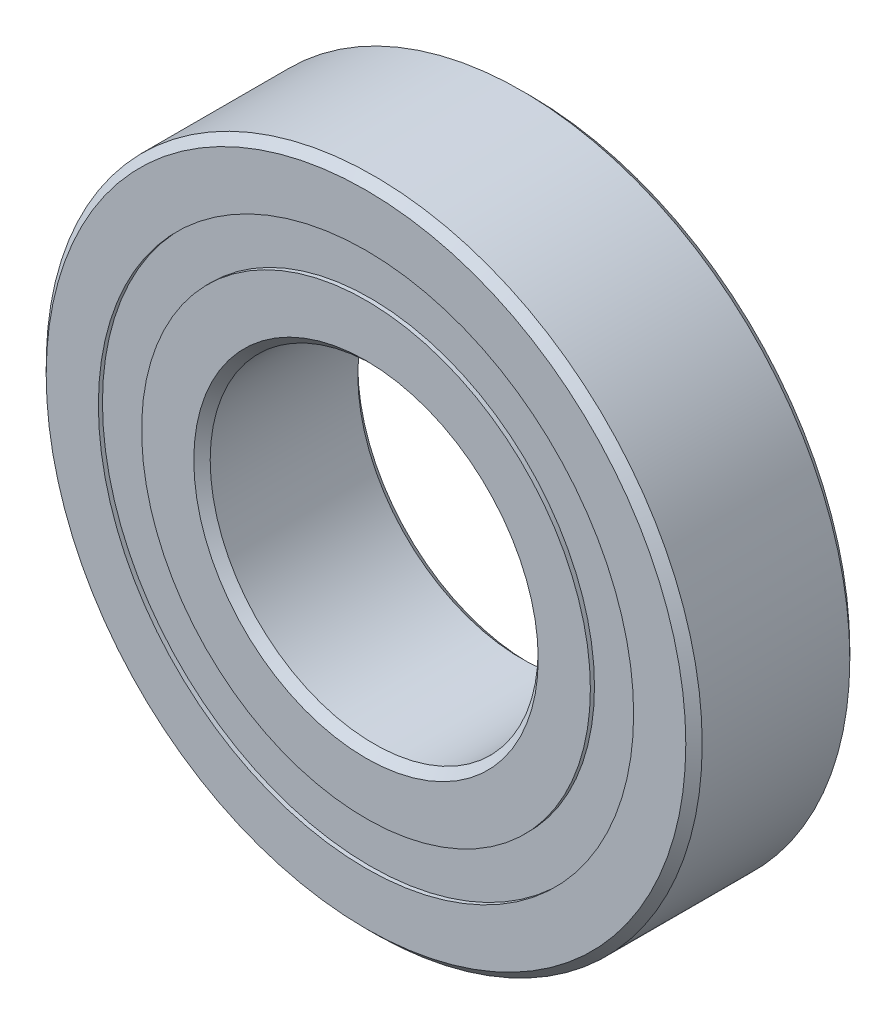
ISO-10303-21;
HEADER;
FILE_DESCRIPTION(('STEP AP214'),'2;1');
FILE_NAME('part.step','',(''),(''),'','','');
FILE_SCHEMA(('AUTOMOTIVE_DESIGN { 1 0 10303 214 1 1 1 1 }'));
ENDSEC;
DATA;
#1=APPLICATION_CONTEXT('core data for automotive mechanical design processes');
#2=APPLICATION_PROTOCOL_DEFINITION('international standard','automotive_design',2000,#1);
#3=PRODUCT_CONTEXT('',#1,'mechanical');
#4=PRODUCT('Part','Part','',(#3));
#5=PRODUCT_RELATED_PRODUCT_CATEGORY('part','',(#4));
#6=PRODUCT_DEFINITION_FORMATION('','',#4);
#7=PRODUCT_DEFINITION_CONTEXT('part definition',#1,'design');
#8=PRODUCT_DEFINITION('design','',#6,#7);
#9=PRODUCT_DEFINITION_SHAPE('','',#8);
#10=(LENGTH_UNIT() NAMED_UNIT(*) SI_UNIT(.MILLI.,.METRE.));
#11=(NAMED_UNIT(*) PLANE_ANGLE_UNIT() SI_UNIT($,.RADIAN.));
#12=(NAMED_UNIT(*) SI_UNIT($,.STERADIAN.) SOLID_ANGLE_UNIT());
#13=UNCERTAINTY_MEASURE_WITH_UNIT(LENGTH_MEASURE(1.E-05),#10,'distance_accuracy_value','');
#14=(GEOMETRIC_REPRESENTATION_CONTEXT(3) GLOBAL_UNCERTAINTY_ASSIGNED_CONTEXT((#13)) GLOBAL_UNIT_ASSIGNED_CONTEXT((#10,
#11,#12)) REPRESENTATION_CONTEXT('',''));
#15=CARTESIAN_POINT('',(0.,0.,0.));
#16=DIRECTION('',(0.,0.,1.));
#17=DIRECTION('',(1.,0.,0.));
#18=AXIS2_PLACEMENT_3D('',#15,#16,#17);
#19=CARTESIAN_POINT('',(0.,20.7247252747253,-6.0325));
#20=DIRECTION('',(0.,0.,1.));
#21=DIRECTION('',(1.,0.,0.));
#22=AXIS2_PLACEMENT_3D('',#19,#20,#21);
#23=PLANE('',#22);
#24=CARTESIAN_POINT('',(0.,0.,-6.0325));
#25=DIRECTION('',(0.,0.,1.));
#26=DIRECTION('',(1.,0.,0.));
#27=AXIS2_PLACEMENT_3D('',#24,#25,#26);
#28=CIRCLE('',#27,20.7247252747253);
#29=CARTESIAN_POINT('',(20.7247252747253,0.,-6.0325));
#30=VERTEX_POINT('',#29);
#31=EDGE_CURVE('E61',#30,#30,#28,.T.);
#32=ORIENTED_EDGE('',*,*,#31,.F.);
#33=EDGE_LOOP('',(#32));
#34=FACE_BOUND('',#33,.T.);
#35=CARTESIAN_POINT('',(0.,0.,-6.0325));
#36=DIRECTION('',(0.,0.,1.));
#37=DIRECTION('',(1.,0.,0.));
#38=AXIS2_PLACEMENT_3D('',#35,#36,#37);
#39=CIRCLE('',#38,17.3752747252747);
#40=CARTESIAN_POINT('',(17.3752747252747,0.,-6.0325));
#41=VERTEX_POINT('',#40);
#42=EDGE_CURVE('E11',#41,#41,#39,.T.);
#43=ORIENTED_EDGE('',*,*,#42,.T.);
#44=EDGE_LOOP('',(#43));
#45=FACE_BOUND('',#44,.T.);
#46=ADVANCED_FACE('F47',(#34,#45),#23,.F.);
#47=CARTESIAN_POINT('',(0.,0.,6.35));
#48=DIRECTION('',(0.,0.,1.));
#49=DIRECTION('',(1.,0.,0.));
#50=AXIS2_PLACEMENT_3D('',#47,#48,#49);
#51=CYLINDRICAL_SURFACE('',#50,17.3752747252747);
#52=ORIENTED_EDGE('',*,*,#42,.F.);
#53=EDGE_LOOP('',(#52));
#54=FACE_BOUND('',#53,.T.);
#55=CARTESIAN_POINT('',(0.,0.,-3.28171342706955));
#56=DIRECTION('',(0.,0.,1.));
#57=DIRECTION('',(1.,0.,0.));
#58=AXIS2_PLACEMENT_3D('',#55,#56,#57);
#59=CIRCLE('',#58,17.3752747252747);
#60=CARTESIAN_POINT('',(17.3752747252747,0.,-3.28171342706955));
#61=VERTEX_POINT('',#60);
#62=EDGE_CURVE('E53',#61,#61,#59,.T.);
#63=ORIENTED_EDGE('',*,*,#62,.T.);
#64=EDGE_LOOP('',(#63));
#65=FACE_BOUND('',#64,.T.);
#66=ADVANCED_FACE('F70',(#54,#65),#51,.F.);
#67=CARTESIAN_POINT('',(0.,20.7247252747253,-3.28171342706955));
#68=DIRECTION('',(0.,0.,-1.));
#69=DIRECTION('',(-1.,0.,0.));
#70=AXIS2_PLACEMENT_3D('',#67,#68,#69);
#71=PLANE('',#70);
#72=ORIENTED_EDGE('',*,*,#62,.F.);
#73=EDGE_LOOP('',(#72));
#74=FACE_BOUND('',#73,.T.);
#75=CARTESIAN_POINT('',(0.,0.,-3.28171342706955));
#76=DIRECTION('',(0.,0.,1.));
#77=DIRECTION('',(1.,0.,0.));
#78=AXIS2_PLACEMENT_3D('',#75,#76,#77);
#79=CIRCLE('',#78,20.7247252747253);
#80=CARTESIAN_POINT('',(20.7247252747253,0.,-3.28171342706955));
#81=VERTEX_POINT('',#80);
#82=EDGE_CURVE('E57',#81,#81,#79,.T.);
#83=ORIENTED_EDGE('',*,*,#82,.T.);
#84=EDGE_LOOP('',(#83));
#85=FACE_BOUND('',#84,.T.);
#86=ADVANCED_FACE('F74',(#74,#85),#71,.F.);
#87=CARTESIAN_POINT('',(0.,0.,6.35));
#88=DIRECTION('',(0.,0.,1.));
#89=DIRECTION('',(1.,0.,0.));
#90=AXIS2_PLACEMENT_3D('',#87,#88,#89);
#91=CYLINDRICAL_SURFACE('',#90,20.7247252747253);
#92=ORIENTED_EDGE('',*,*,#82,.F.);
#93=EDGE_LOOP('',(#92));
#94=FACE_BOUND('',#93,.T.);
#95=ORIENTED_EDGE('',*,*,#31,.T.);
#96=EDGE_LOOP('',(#95));
#97=FACE_BOUND('',#96,.T.);
#98=ADVANCED_FACE('F67',(#94,#97),#91,.T.);
#99=CLOSED_SHELL('',(#46,#66,#86,#98));
#100=MANIFOLD_SOLID_BREP('B2',#99);
#101=CARTESIAN_POINT('',(0.,20.7247252747253,6.0325));
#102=DIRECTION('',(0.,0.,-1.));
#103=DIRECTION('',(-1.,0.,0.));
#104=AXIS2_PLACEMENT_3D('',#101,#102,#103);
#105=PLANE('',#104);
#106=CARTESIAN_POINT('',(0.,0.,6.0325));
#107=DIRECTION('',(0.,0.,1.));
#108=DIRECTION('',(1.,0.,0.));
#109=AXIS2_PLACEMENT_3D('',#106,#107,#108);
#110=CIRCLE('',#109,17.3752747252747);
#111=CARTESIAN_POINT('',(17.3752747252747,0.,6.0325));
#112=VERTEX_POINT('',#111);
#113=EDGE_CURVE('E46',#112,#112,#110,.T.);
#114=ORIENTED_EDGE('',*,*,#113,.F.);
#115=EDGE_LOOP('',(#114));
#116=FACE_BOUND('',#115,.T.);
#117=CARTESIAN_POINT('',(0.,0.,6.0325));
#118=DIRECTION('',(0.,0.,1.));
#119=DIRECTION('',(1.,0.,0.));
#120=AXIS2_PLACEMENT_3D('',#117,#118,#119);
#121=CIRCLE('',#120,20.7247252747253);
#122=CARTESIAN_POINT('',(20.7247252747253,0.,6.0325));
#123=VERTEX_POINT('',#122);
#124=EDGE_CURVE('E129',#123,#123,#121,.T.);
#125=ORIENTED_EDGE('',*,*,#124,.T.);
#126=EDGE_LOOP('',(#125));
#127=FACE_BOUND('',#126,.T.);
#128=ADVANCED_FACE('F115',(#116,#127),#105,.F.);
#129=CARTESIAN_POINT('',(0.,0.,6.35));
#130=DIRECTION('',(0.,0.,1.));
#131=DIRECTION('',(1.,0.,0.));
#132=AXIS2_PLACEMENT_3D('',#129,#130,#131);
#133=CYLINDRICAL_SURFACE('',#132,17.3752747252747);
#134=CARTESIAN_POINT('',(0.,0.,3.28171342706955));
#135=DIRECTION('',(0.,0.,1.));
#136=DIRECTION('',(1.,0.,0.));
#137=AXIS2_PLACEMENT_3D('',#134,#135,#136);
#138=CIRCLE('',#137,17.3752747252747);
#139=CARTESIAN_POINT('',(17.3752747252747,0.,3.28171342706955));
#140=VERTEX_POINT('',#139);
#141=EDGE_CURVE('E121',#140,#140,#138,.T.);
#142=ORIENTED_EDGE('',*,*,#141,.F.);
#143=EDGE_LOOP('',(#142));
#144=FACE_BOUND('',#143,.T.);
#145=ORIENTED_EDGE('',*,*,#113,.T.);
#146=EDGE_LOOP('',(#145));
#147=FACE_BOUND('',#146,.T.);
#148=ADVANCED_FACE('F144',(#144,#147),#133,.F.);
#149=CARTESIAN_POINT('',(0.,20.7247252747253,3.28171342706955));
#150=DIRECTION('',(0.,0.,1.));
#151=DIRECTION('',(1.,0.,0.));
#152=AXIS2_PLACEMENT_3D('',#149,#150,#151);
#153=PLANE('',#152);
#154=CARTESIAN_POINT('',(0.,0.,3.28171342706955));
#155=DIRECTION('',(0.,0.,1.));
#156=DIRECTION('',(1.,0.,0.));
#157=AXIS2_PLACEMENT_3D('',#154,#155,#156);
#158=CIRCLE('',#157,20.7247252747253);
#159=CARTESIAN_POINT('',(20.7247252747253,0.,3.28171342706955));
#160=VERTEX_POINT('',#159);
#161=EDGE_CURVE('E125',#160,#160,#158,.T.);
#162=ORIENTED_EDGE('',*,*,#161,.F.);
#163=EDGE_LOOP('',(#162));
#164=FACE_BOUND('',#163,.T.);
#165=ORIENTED_EDGE('',*,*,#141,.T.);
#166=EDGE_LOOP('',(#165));
#167=FACE_BOUND('',#166,.T.);
#168=ADVANCED_FACE('F139',(#164,#167),#153,.F.);
#169=CARTESIAN_POINT('',(0.,0.,6.35));
#170=DIRECTION('',(0.,0.,1.));
#171=DIRECTION('',(1.,0.,0.));
#172=AXIS2_PLACEMENT_3D('',#169,#170,#171);
#173=CYLINDRICAL_SURFACE('',#172,20.7247252747253);
#174=ORIENTED_EDGE('',*,*,#124,.F.);
#175=EDGE_LOOP('',(#174));
#176=FACE_BOUND('',#175,.T.);
#177=ORIENTED_EDGE('',*,*,#161,.T.);
#178=EDGE_LOOP('',(#177));
#179=FACE_BOUND('',#178,.T.);
#180=ADVANCED_FACE('F136',(#176,#179),#173,.T.);
#181=CLOSED_SHELL('',(#128,#148,#168,#180));
#182=MANIFOLD_SOLID_BREP('B6',#181);
#183=CARTESIAN_POINT('',(-9.52499999999979,16.4977839420937,0.));
#184=DIRECTION('',(0.,0.,1.));
#185=DIRECTION('',(-0.499999999999989,0.866025403784445,0.));
#186=AXIS2_PLACEMENT_3D('',#183,#184,#185);
#187=SPHERICAL_SURFACE('',#186,3.28171342706955);
#188=CARTESIAN_POINT('',(-9.52499999999979,16.4977839420937,3.28171342706955));
#189=VERTEX_POINT('',#188);
#190=VERTEX_LOOP('',#189);
#191=FACE_BOUND('',#190,.T.);
#192=ADVANCED_FACE('F183',(#191),#187,.T.);
#193=CLOSED_SHELL('',(#192));
#194=MANIFOLD_SOLID_BREP('B41',#193);
#195=CARTESIAN_POINT('',(-16.4977839420934,9.52500000000019,0.));
#196=DIRECTION('',(0.,0.,1.));
#197=DIRECTION('',(-0.866025403784433,0.50000000000001,0.));
#198=AXIS2_PLACEMENT_3D('',#195,#196,#197);
#199=SPHERICAL_SURFACE('',#198,3.28171342706955);
#200=CARTESIAN_POINT('',(-16.4977839420934,9.52500000000019,3.28171342706955));
#201=VERTEX_POINT('',#200);
#202=VERTEX_LOOP('',#201);
#203=FACE_BOUND('',#202,.T.);
#204=ADVANCED_FACE('F204',(#203),#199,.T.);
#205=CLOSED_SHELL('',(#204));
#206=MANIFOLD_SOLID_BREP('B111',#205);
#207=CARTESIAN_POINT('',(-19.05,1.99538158514885E-13,0.));
#208=DIRECTION('',(0.,0.,1.));
#209=DIRECTION('',(-1.,0.,0.));
#210=AXIS2_PLACEMENT_3D('',#207,#208,#209);
#211=SPHERICAL_SURFACE('',#210,3.28171342706955);
#212=CARTESIAN_POINT('',(-19.05,1.99538158514885E-13,3.28171342706955));
#213=VERTEX_POINT('',#212);
#214=VERTEX_LOOP('',#213);
#215=FACE_BOUND('',#214,.T.);
#216=ADVANCED_FACE('F225',(#215),#211,.T.);
#217=CLOSED_SHELL('',(#216));
#218=MANIFOLD_SOLID_BREP('B179',#217);
#219=CARTESIAN_POINT('',(-16.4977839420936,-9.52499999999985,0.));
#220=DIRECTION('',(0.,0.,1.));
#221=DIRECTION('',(-0.866025403784443,-0.499999999999992,0.));
#222=AXIS2_PLACEMENT_3D('',#219,#220,#221);
#223=SPHERICAL_SURFACE('',#222,3.28171342706955);
#224=CARTESIAN_POINT('',(-16.4977839420936,-9.52499999999985,3.28171342706955));
#225=VERTEX_POINT('',#224);
#226=VERTEX_LOOP('',#225);
#227=FACE_BOUND('',#226,.T.);
#228=ADVANCED_FACE('F246',(#227),#223,.T.);
#229=CLOSED_SHELL('',(#228));
#230=MANIFOLD_SOLID_BREP('B200',#229);
#231=CARTESIAN_POINT('',(-9.52500000000013,-16.4977839420935,0.));
#232=DIRECTION('',(0.,0.,1.));
#233=DIRECTION('',(-0.500000000000007,-0.866025403784435,0.));
#234=AXIS2_PLACEMENT_3D('',#231,#232,#233);
#235=SPHERICAL_SURFACE('',#234,3.28171342706955);
#236=CARTESIAN_POINT('',(-9.52500000000013,-16.4977839420935,3.28171342706955));
#237=VERTEX_POINT('',#236);
#238=VERTEX_LOOP('',#237);
#239=FACE_BOUND('',#238,.T.);
#240=ADVANCED_FACE('F267',(#239),#235,.T.);
#241=CLOSED_SHELL('',(#240));
#242=MANIFOLD_SOLID_BREP('B221',#241);
#243=CARTESIAN_POINT('',(-1.33025439009923E-13,-19.05,0.));
#244=DIRECTION('',(0.,0.,1.));
#245=DIRECTION('',(0.,-1.,0.));
#246=AXIS2_PLACEMENT_3D('',#243,#244,#245);
#247=SPHERICAL_SURFACE('',#246,3.28171342706955);
#248=CARTESIAN_POINT('',(-1.33025439009923E-13,-19.05,3.28171342706955));
#249=VERTEX_POINT('',#248);
#250=VERTEX_LOOP('',#249);
#251=FACE_BOUND('',#250,.T.);
#252=ADVANCED_FACE('F288',(#251),#247,.T.);
#253=CLOSED_SHELL('',(#252));
#254=MANIFOLD_SOLID_BREP('B242',#253);
#255=CARTESIAN_POINT('',(9.5249999999999,-16.4977839420936,0.));
#256=DIRECTION('',(0.,0.,1.));
#257=DIRECTION('',(0.499999999999995,-0.866025403784442,0.));
#258=AXIS2_PLACEMENT_3D('',#255,#256,#257);
#259=SPHERICAL_SURFACE('',#258,3.28171342706955);
#260=CARTESIAN_POINT('',(9.5249999999999,-16.4977839420936,3.28171342706955));
#261=VERTEX_POINT('',#260);
#262=VERTEX_LOOP('',#261);
#263=FACE_BOUND('',#262,.T.);
#264=ADVANCED_FACE('F309',(#263),#259,.T.);
#265=CLOSED_SHELL('',(#264));
#266=MANIFOLD_SOLID_BREP('B263',#265);
#267=CARTESIAN_POINT('',(16.4977839420935,-9.52500000000008,0.));
#268=DIRECTION('',(0.,0.,1.));
#269=DIRECTION('',(0.866025403784436,-0.500000000000004,0.));
#270=AXIS2_PLACEMENT_3D('',#267,#268,#269);
#271=SPHERICAL_SURFACE('',#270,3.28171342706955);
#272=CARTESIAN_POINT('',(16.4977839420935,-9.52500000000008,3.28171342706955));
#273=VERTEX_POINT('',#272);
#274=VERTEX_LOOP('',#273);
#275=FACE_BOUND('',#274,.T.);
#276=ADVANCED_FACE('F330',(#275),#271,.T.);
#277=CLOSED_SHELL('',(#276));
#278=MANIFOLD_SOLID_BREP('B284',#277);
#279=CARTESIAN_POINT('',(19.05,0.,0.));
#280=DIRECTION('',(0.,0.,1.));
#281=DIRECTION('',(1.,0.,0.));
#282=AXIS2_PLACEMENT_3D('',#279,#280,#281);
#283=SPHERICAL_SURFACE('',#282,3.28171342706955);
#284=CARTESIAN_POINT('',(19.05,0.,3.28171342706955));
#285=VERTEX_POINT('',#284);
#286=VERTEX_LOOP('',#285);
#287=FACE_BOUND('',#286,.T.);
#288=ADVANCED_FACE('F351',(#287),#283,.T.);
#289=CLOSED_SHELL('',(#288));
#290=MANIFOLD_SOLID_BREP('B305',#289);
#291=CARTESIAN_POINT('',(16.4977839420936,9.52499999999996,0.));
#292=DIRECTION('',(0.,0.,1.));
#293=DIRECTION('',(0.86602540378444,0.499999999999998,0.));
#294=AXIS2_PLACEMENT_3D('',#291,#292,#293);
#295=SPHERICAL_SURFACE('',#294,3.28171342706955);
#296=CARTESIAN_POINT('',(16.4977839420936,9.52499999999996,3.28171342706955));
#297=VERTEX_POINT('',#296);
#298=VERTEX_LOOP('',#297);
#299=FACE_BOUND('',#298,.T.);
#300=ADVANCED_FACE('F372',(#299),#295,.T.);
#301=CLOSED_SHELL('',(#300));
#302=MANIFOLD_SOLID_BREP('B326',#301);
#303=CARTESIAN_POINT('',(9.52500000000002,16.4977839420935,0.));
#304=DIRECTION('',(0.,0.,1.));
#305=DIRECTION('',(0.500000000000001,0.866025403784438,0.));
#306=AXIS2_PLACEMENT_3D('',#303,#304,#305);
#307=SPHERICAL_SURFACE('',#306,3.28171342706955);
#308=CARTESIAN_POINT('',(9.52500000000002,16.4977839420935,3.28171342706955));
#309=VERTEX_POINT('',#308);
#310=VERTEX_LOOP('',#309);
#311=FACE_BOUND('',#310,.T.);
#312=ADVANCED_FACE('F393',(#311),#307,.T.);
#313=CLOSED_SHELL('',(#312));
#314=MANIFOLD_SOLID_BREP('B347',#313);
#315=CARTESIAN_POINT('',(0.,19.05,0.));
#316=DIRECTION('',(0.,0.,1.));
#317=DIRECTION('',(0.,1.,0.));
#318=AXIS2_PLACEMENT_3D('',#315,#316,#317);
#319=SPHERICAL_SURFACE('',#318,3.28171342706955);
#320=CARTESIAN_POINT('',(0.,19.05,3.28171342706955));
#321=VERTEX_POINT('',#320);
#322=VERTEX_LOOP('',#321);
#323=FACE_BOUND('',#322,.T.);
#324=ADVANCED_FACE('F416',(#323),#319,.T.);
#325=CLOSED_SHELL('',(#324));
#326=MANIFOLD_SOLID_BREP('B368',#325);
#327=CARTESIAN_POINT('',(0.,17.3752747252747,6.35));
#328=DIRECTION('',(0.,0.,-1.));
#329=DIRECTION('',(-1.,0.,0.));
#330=AXIS2_PLACEMENT_3D('',#327,#328,#329);
#331=PLANE('',#330);
#332=CARTESIAN_POINT('',(0.,0.,6.35));
#333=DIRECTION('',(0.,0.,1.));
#334=DIRECTION('',(1.,0.,0.));
#335=AXIS2_PLACEMENT_3D('',#332,#333,#334);
#336=CIRCLE('',#335,13.335);
#337=CARTESIAN_POINT('',(13.335,0.,6.35));
#338=VERTEX_POINT('',#337);
#339=EDGE_CURVE('E464',#338,#338,#336,.T.);
#340=ORIENTED_EDGE('',*,*,#339,.F.);
#341=EDGE_LOOP('',(#340));
#342=FACE_BOUND('',#341,.T.);
#343=CARTESIAN_POINT('',(0.,0.,6.35));
#344=DIRECTION('',(0.,0.,1.));
#345=DIRECTION('',(1.,0.,0.));
#346=AXIS2_PLACEMENT_3D('',#343,#344,#345);
#347=CIRCLE('',#346,17.3752747252747);
#348=CARTESIAN_POINT('',(17.3752747252747,0.,6.35));
#349=VERTEX_POINT('',#348);
#350=EDGE_CURVE('E415',#349,#349,#347,.T.);
#351=ORIENTED_EDGE('',*,*,#350,.T.);
#352=EDGE_LOOP('',(#351));
#353=FACE_BOUND('',#352,.T.);
#354=ADVANCED_FACE('F436',(#342,#353),#331,.F.);
#355=CARTESIAN_POINT('',(0.,0.,6.35));
#356=DIRECTION('',(0.,0.,1.));
#357=DIRECTION('',(1.,0.,0.));
#358=AXIS2_PLACEMENT_3D('',#355,#356,#357);
#359=CYLINDRICAL_SURFACE('',#358,17.3752747252747);
#360=ORIENTED_EDGE('',*,*,#350,.F.);
#361=EDGE_LOOP('',(#360));
#362=FACE_BOUND('',#361,.T.);
#363=CARTESIAN_POINT('',(0.,0.,2.82222222222222));
#364=DIRECTION('',(0.,0.,1.));
#365=DIRECTION('',(1.,0.,0.));
#366=AXIS2_PLACEMENT_3D('',#363,#364,#365);
#367=CIRCLE('',#366,17.3752747252747);
#368=CARTESIAN_POINT('',(17.3752747252747,0.,2.82222222222222));
#369=VERTEX_POINT('',#368);
#370=EDGE_CURVE('E442',#369,#369,#367,.T.);
#371=ORIENTED_EDGE('',*,*,#370,.T.);
#372=EDGE_LOOP('',(#371));
#373=FACE_BOUND('',#372,.T.);
#374=ADVANCED_FACE('F471',(#362,#373),#359,.T.);
#375=CARTESIAN_POINT('',(0.,0.,0.));
#376=DIRECTION('',(0.,0.,1.));
#377=DIRECTION('',(1.,0.,0.));
#378=AXIS2_PLACEMENT_3D('',#375,#376,#377);
#379=TOROIDAL_SURFACE('',#378,19.05,3.28171342706954);
#380=ORIENTED_EDGE('',*,*,#370,.F.);
#381=EDGE_LOOP('',(#380));
#382=FACE_BOUND('',#381,.T.);
#383=CARTESIAN_POINT('',(0.,0.,-2.82222222222223));
#384=DIRECTION('',(0.,0.,1.));
#385=DIRECTION('',(1.,0.,0.));
#386=AXIS2_PLACEMENT_3D('',#383,#384,#385);
#387=CIRCLE('',#386,17.3752747252747);
#388=CARTESIAN_POINT('',(17.3752747252747,0.,-2.82222222222223));
#389=VERTEX_POINT('',#388);
#390=EDGE_CURVE('E446',#389,#389,#387,.T.);
#391=ORIENTED_EDGE('',*,*,#390,.T.);
#392=EDGE_LOOP('',(#391));
#393=FACE_BOUND('',#392,.T.);
#394=ADVANCED_FACE('F475',(#382,#393),#379,.F.);
#395=CARTESIAN_POINT('',(0.,0.,6.35));
#396=DIRECTION('',(0.,0.,1.));
#397=DIRECTION('',(1.,0.,0.));
#398=AXIS2_PLACEMENT_3D('',#395,#396,#397);
#399=CYLINDRICAL_SURFACE('',#398,17.3752747252747);
#400=ORIENTED_EDGE('',*,*,#390,.F.);
#401=EDGE_LOOP('',(#400));
#402=FACE_BOUND('',#401,.T.);
#403=CARTESIAN_POINT('',(0.,0.,-6.35));
#404=DIRECTION('',(0.,0.,1.));
#405=DIRECTION('',(1.,0.,0.));
#406=AXIS2_PLACEMENT_3D('',#403,#404,#405);
#407=CIRCLE('',#406,17.3752747252747);
#408=CARTESIAN_POINT('',(17.3752747252747,0.,-6.35));
#409=VERTEX_POINT('',#408);
#410=EDGE_CURVE('E450',#409,#409,#407,.T.);
#411=ORIENTED_EDGE('',*,*,#410,.T.);
#412=EDGE_LOOP('',(#411));
#413=FACE_BOUND('',#412,.T.);
#414=ADVANCED_FACE('F480',(#402,#413),#399,.T.);
#415=CARTESIAN_POINT('',(0.,13.335,-6.35));
#416=DIRECTION('',(0.,0.,1.));
#417=DIRECTION('',(1.,0.,0.));
#418=AXIS2_PLACEMENT_3D('',#415,#416,#417);
#419=PLANE('',#418);
#420=ORIENTED_EDGE('',*,*,#410,.F.);
#421=EDGE_LOOP('',(#420));
#422=FACE_BOUND('',#421,.T.);
#423=CARTESIAN_POINT('',(0.,0.,-6.35));
#424=DIRECTION('',(0.,0.,1.));
#425=DIRECTION('',(1.,0.,0.));
#426=AXIS2_PLACEMENT_3D('',#423,#424,#425);
#427=CIRCLE('',#426,13.335);
#428=CARTESIAN_POINT('',(13.335,0.,-6.35));
#429=VERTEX_POINT('',#428);
#430=EDGE_CURVE('E455',#429,#429,#427,.T.);
#431=ORIENTED_EDGE('',*,*,#430,.T.);
#432=EDGE_LOOP('',(#431));
#433=FACE_BOUND('',#432,.T.);
#434=ADVANCED_FACE('F486',(#422,#433),#419,.F.);
#435=CARTESIAN_POINT('',(0.,0.,-5.715));
#436=DIRECTION('',(0.,0.,-1.));
#437=DIRECTION('',(-1.,0.,0.));
#438=AXIS2_PLACEMENT_3D('',#435,#436,#437);
#439=CONICAL_SURFACE('',#438,12.7,0.785398163397444);
#440=ORIENTED_EDGE('',*,*,#430,.F.);
#441=EDGE_LOOP('',(#440));
#442=FACE_BOUND('',#441,.T.);
#443=CARTESIAN_POINT('',(0.,0.,-5.715));
#444=DIRECTION('',(0.,0.,1.));
#445=DIRECTION('',(1.,0.,0.));
#446=AXIS2_PLACEMENT_3D('',#443,#444,#445);
#447=CIRCLE('',#446,12.7);
#448=CARTESIAN_POINT('',(12.7,0.,-5.715));
#449=VERTEX_POINT('',#448);
#450=EDGE_CURVE('E458',#449,#449,#447,.T.);
#451=ORIENTED_EDGE('',*,*,#450,.T.);
#452=EDGE_LOOP('',(#451));
#453=FACE_BOUND('',#452,.T.);
#454=ADVANCED_FACE('F490',(#442,#453),#439,.F.);
#455=CARTESIAN_POINT('',(0.,0.,6.35));
#456=DIRECTION('',(0.,0.,1.));
#457=DIRECTION('',(1.,0.,0.));
#458=AXIS2_PLACEMENT_3D('',#455,#456,#457);
#459=CYLINDRICAL_SURFACE('',#458,12.7);
#460=ORIENTED_EDGE('',*,*,#450,.F.);
#461=EDGE_LOOP('',(#460));
#462=FACE_BOUND('',#461,.T.);
#463=CARTESIAN_POINT('',(0.,0.,5.71500000000001));
#464=DIRECTION('',(0.,0.,1.));
#465=DIRECTION('',(1.,0.,0.));
#466=AXIS2_PLACEMENT_3D('',#463,#464,#465);
#467=CIRCLE('',#466,12.7);
#468=CARTESIAN_POINT('',(12.7,0.,5.71500000000001));
#469=VERTEX_POINT('',#468);
#470=EDGE_CURVE('E461',#469,#469,#467,.T.);
#471=ORIENTED_EDGE('',*,*,#470,.T.);
#472=EDGE_LOOP('',(#471));
#473=FACE_BOUND('',#472,.T.);
#474=ADVANCED_FACE('F494',(#462,#473),#459,.F.);
#475=CARTESIAN_POINT('',(0.,0.,6.35));
#476=DIRECTION('',(0.,0.,1.));
#477=DIRECTION('',(1.,0.,0.));
#478=AXIS2_PLACEMENT_3D('',#475,#476,#477);
#479=CONICAL_SURFACE('',#478,13.335,0.785398163397454);
#480=ORIENTED_EDGE('',*,*,#470,.F.);
#481=EDGE_LOOP('',(#480));
#482=FACE_BOUND('',#481,.T.);
#483=ORIENTED_EDGE('',*,*,#339,.T.);
#484=EDGE_LOOP('',(#483));
#485=FACE_BOUND('',#484,.T.);
#486=ADVANCED_FACE('F468',(#482,#485),#479,.F.);
#487=CLOSED_SHELL('',(#354,#374,#394,#414,#434,#454,#474,#486));
#488=MANIFOLD_SOLID_BREP('B389',#487);
#489=CARTESIAN_POINT('',(0.,0.,5.715));
#490=DIRECTION('',(0.,0.,-1.));
#491=DIRECTION('',(-1.,0.,0.));
#492=AXIS2_PLACEMENT_3D('',#489,#490,#491);
#493=CONICAL_SURFACE('',#492,25.4,0.785398163397444);
#494=CARTESIAN_POINT('',(0.,0.,6.35));
#495=DIRECTION('',(0.,0.,1.));
#496=DIRECTION('',(1.,0.,0.));
#497=AXIS2_PLACEMENT_3D('',#494,#495,#496);
#498=CIRCLE('',#497,24.765);
#499=CARTESIAN_POINT('',(24.765,0.,6.35));
#500=VERTEX_POINT('',#499);
#501=EDGE_CURVE('E586',#500,#500,#498,.T.);
#502=ORIENTED_EDGE('',*,*,#501,.F.);
#503=EDGE_LOOP('',(#502));
#504=FACE_BOUND('',#503,.T.);
#505=CARTESIAN_POINT('',(0.,0.,5.715));
#506=DIRECTION('',(0.,0.,1.));
#507=DIRECTION('',(1.,0.,0.));
#508=AXIS2_PLACEMENT_3D('',#505,#506,#507);
#509=CIRCLE('',#508,25.4);
#510=CARTESIAN_POINT('',(25.4,0.,5.715));
#511=VERTEX_POINT('',#510);
#512=EDGE_CURVE('E435',#511,#511,#509,.T.);
#513=ORIENTED_EDGE('',*,*,#512,.T.);
#514=EDGE_LOOP('',(#513));
#515=FACE_BOUND('',#514,.T.);
#516=ADVANCED_FACE('F558',(#504,#515),#493,.T.);
#517=CARTESIAN_POINT('',(0.,0.,6.35));
#518=DIRECTION('',(0.,0.,1.));
#519=DIRECTION('',(1.,0.,0.));
#520=AXIS2_PLACEMENT_3D('',#517,#518,#519);
#521=CYLINDRICAL_SURFACE('',#520,25.4);
#522=ORIENTED_EDGE('',*,*,#512,.F.);
#523=EDGE_LOOP('',(#522));
#524=FACE_BOUND('',#523,.T.);
#525=CARTESIAN_POINT('',(0.,0.,-5.715));
#526=DIRECTION('',(0.,0.,1.));
#527=DIRECTION('',(1.,0.,0.));
#528=AXIS2_PLACEMENT_3D('',#525,#526,#527);
#529=CIRCLE('',#528,25.4);
#530=CARTESIAN_POINT('',(25.4,0.,-5.715));
#531=VERTEX_POINT('',#530);
#532=EDGE_CURVE('E564',#531,#531,#529,.T.);
#533=ORIENTED_EDGE('',*,*,#532,.T.);
#534=EDGE_LOOP('',(#533));
#535=FACE_BOUND('',#534,.T.);
#536=ADVANCED_FACE('F593',(#524,#535),#521,.T.);
#537=CARTESIAN_POINT('',(0.,0.,-6.35));
#538=DIRECTION('',(0.,0.,1.));
#539=DIRECTION('',(1.,0.,0.));
#540=AXIS2_PLACEMENT_3D('',#537,#538,#539);
#541=CONICAL_SURFACE('',#540,24.765,0.785398163397444);
#542=ORIENTED_EDGE('',*,*,#532,.F.);
#543=EDGE_LOOP('',(#542));
#544=FACE_BOUND('',#543,.T.);
#545=CARTESIAN_POINT('',(0.,0.,-6.35));
#546=DIRECTION('',(0.,0.,1.));
#547=DIRECTION('',(1.,0.,0.));
#548=AXIS2_PLACEMENT_3D('',#545,#546,#547);
#549=CIRCLE('',#548,24.765);
#550=CARTESIAN_POINT('',(24.765,0.,-6.35));
#551=VERTEX_POINT('',#550);
#552=EDGE_CURVE('E568',#551,#551,#549,.T.);
#553=ORIENTED_EDGE('',*,*,#552,.T.);
#554=EDGE_LOOP('',(#553));
#555=FACE_BOUND('',#554,.T.);
#556=ADVANCED_FACE('F597',(#544,#555),#541,.T.);
#557=CARTESIAN_POINT('',(0.,24.765,-6.35));
#558=DIRECTION('',(0.,0.,1.));
#559=DIRECTION('',(1.,0.,0.));
#560=AXIS2_PLACEMENT_3D('',#557,#558,#559);
#561=PLANE('',#560);
#562=ORIENTED_EDGE('',*,*,#552,.F.);
#563=EDGE_LOOP('',(#562));
#564=FACE_BOUND('',#563,.T.);
#565=CARTESIAN_POINT('',(0.,0.,-6.35));
#566=DIRECTION('',(0.,0.,1.));
#567=DIRECTION('',(1.,0.,0.));
#568=AXIS2_PLACEMENT_3D('',#565,#566,#567);
#569=CIRCLE('',#568,20.7247252747253);
#570=CARTESIAN_POINT('',(20.7247252747253,0.,-6.35));
#571=VERTEX_POINT('',#570);
#572=EDGE_CURVE('E572',#571,#571,#569,.T.);
#573=ORIENTED_EDGE('',*,*,#572,.T.);
#574=EDGE_LOOP('',(#573));
#575=FACE_BOUND('',#574,.T.);
#576=ADVANCED_FACE('F602',(#564,#575),#561,.F.);
#577=CARTESIAN_POINT('',(0.,0.,6.35));
#578=DIRECTION('',(0.,0.,1.));
#579=DIRECTION('',(1.,0.,0.));
#580=AXIS2_PLACEMENT_3D('',#577,#578,#579);
#581=CYLINDRICAL_SURFACE('',#580,20.7247252747253);
#582=ORIENTED_EDGE('',*,*,#572,.F.);
#583=EDGE_LOOP('',(#582));
#584=FACE_BOUND('',#583,.T.);
#585=CARTESIAN_POINT('',(0.,0.,-2.82222222222222));
#586=DIRECTION('',(0.,0.,1.));
#587=DIRECTION('',(1.,0.,0.));
#588=AXIS2_PLACEMENT_3D('',#585,#586,#587);
#589=CIRCLE('',#588,20.7247252747253);
#590=CARTESIAN_POINT('',(20.7247252747253,0.,-2.82222222222222));
#591=VERTEX_POINT('',#590);
#592=EDGE_CURVE('E577',#591,#591,#589,.T.);
#593=ORIENTED_EDGE('',*,*,#592,.T.);
#594=EDGE_LOOP('',(#593));
#595=FACE_BOUND('',#594,.T.);
#596=ADVANCED_FACE('F608',(#584,#595),#581,.F.);
#597=CARTESIAN_POINT('',(0.,0.,0.));
#598=DIRECTION('',(0.,0.,1.));
#599=DIRECTION('',(1.,0.,0.));
#600=AXIS2_PLACEMENT_3D('',#597,#598,#599);
#601=TOROIDAL_SURFACE('',#600,19.05,3.28171342706955);
#602=ORIENTED_EDGE('',*,*,#592,.F.);
#603=EDGE_LOOP('',(#602));
#604=FACE_BOUND('',#603,.T.);
#605=CARTESIAN_POINT('',(0.,0.,2.82222222222222));
#606=DIRECTION('',(0.,0.,1.));
#607=DIRECTION('',(1.,0.,0.));
#608=AXIS2_PLACEMENT_3D('',#605,#606,#607);
#609=CIRCLE('',#608,20.7247252747253);
#610=CARTESIAN_POINT('',(20.7247252747253,0.,2.82222222222222));
#611=VERTEX_POINT('',#610);
#612=EDGE_CURVE('E580',#611,#611,#609,.T.);
#613=ORIENTED_EDGE('',*,*,#612,.T.);
#614=EDGE_LOOP('',(#613));
#615=FACE_BOUND('',#614,.T.);
#616=ADVANCED_FACE('F612',(#604,#615),#601,.F.);
#617=CARTESIAN_POINT('',(0.,0.,6.35));
#618=DIRECTION('',(0.,0.,1.));
#619=DIRECTION('',(1.,0.,0.));
#620=AXIS2_PLACEMENT_3D('',#617,#618,#619);
#621=CYLINDRICAL_SURFACE('',#620,20.7247252747253);
#622=ORIENTED_EDGE('',*,*,#612,.F.);
#623=EDGE_LOOP('',(#622));
#624=FACE_BOUND('',#623,.T.);
#625=CARTESIAN_POINT('',(0.,0.,6.35));
#626=DIRECTION('',(0.,0.,1.));
#627=DIRECTION('',(1.,0.,0.));
#628=AXIS2_PLACEMENT_3D('',#625,#626,#627);
#629=CIRCLE('',#628,20.7247252747253);
#630=CARTESIAN_POINT('',(20.7247252747253,0.,6.35));
#631=VERTEX_POINT('',#630);
#632=EDGE_CURVE('E583',#631,#631,#629,.T.);
#633=ORIENTED_EDGE('',*,*,#632,.T.);
#634=EDGE_LOOP('',(#633));
#635=FACE_BOUND('',#634,.T.);
#636=ADVANCED_FACE('F616',(#624,#635),#621,.F.);
#637=CARTESIAN_POINT('',(0.,24.765,6.35));
#638=DIRECTION('',(0.,0.,-1.));
#639=DIRECTION('',(-1.,0.,0.));
#640=AXIS2_PLACEMENT_3D('',#637,#638,#639);
#641=PLANE('',#640);
#642=ORIENTED_EDGE('',*,*,#632,.F.);
#643=EDGE_LOOP('',(#642));
#644=FACE_BOUND('',#643,.T.);
#645=ORIENTED_EDGE('',*,*,#501,.T.);
#646=EDGE_LOOP('',(#645));
#647=FACE_BOUND('',#646,.T.);
#648=ADVANCED_FACE('F590',(#644,#647),#641,.F.);
#649=CLOSED_SHELL('',(#516,#536,#556,#576,#596,#616,#636,#648));
#650=MANIFOLD_SOLID_BREP('B410',#649);
#651=ADVANCED_BREP_SHAPE_REPRESENTATION('',(#18,#100,#182,#194,#206,#218,#230,#242,#254,#266,
#278,#290,#302,#314,#326,#488,#650),#14);
#652=SHAPE_DEFINITION_REPRESENTATION(#9,#651);
ENDSEC;
END-ISO-10303-21;
